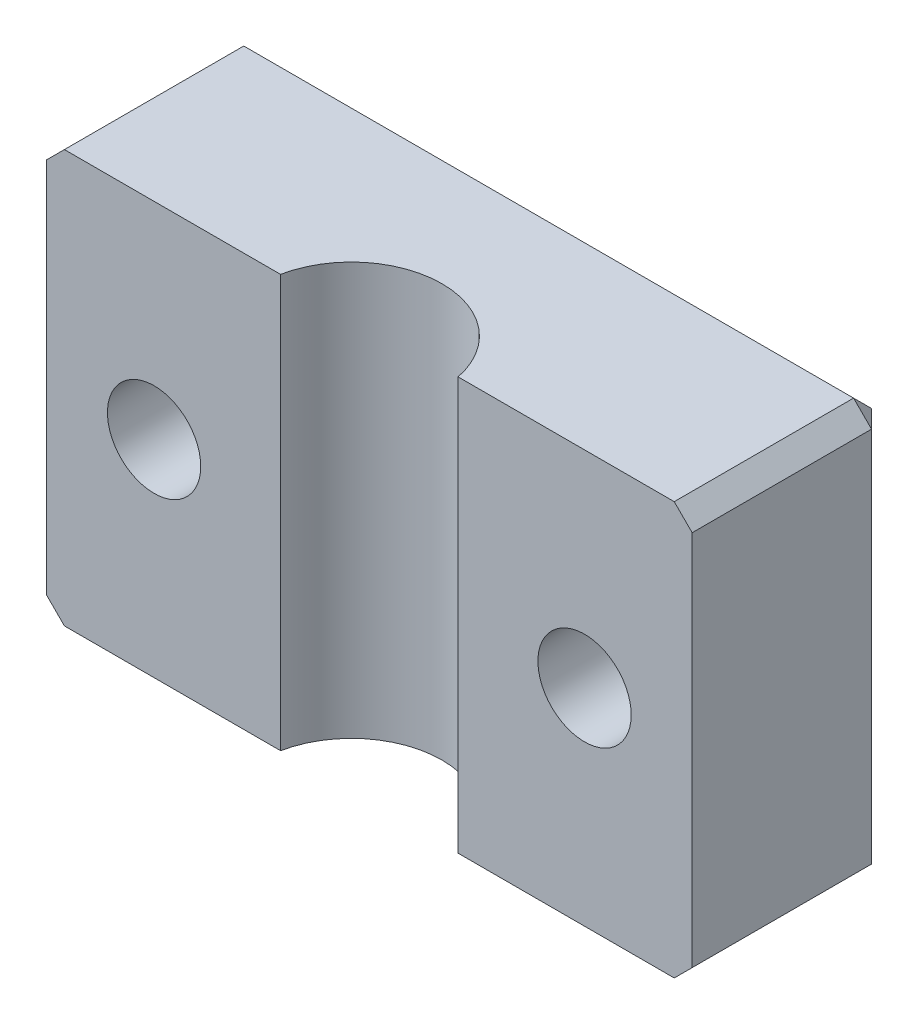
ISO-10303-21;
HEADER;
FILE_DESCRIPTION(('STEP AP214'),'2;1');
FILE_NAME('part.step','',(''),(''),'','','');
FILE_SCHEMA(('AUTOMOTIVE_DESIGN { 1 0 10303 214 1 1 1 1 }'));
ENDSEC;
DATA;
#1=APPLICATION_CONTEXT('core data for automotive mechanical design processes');
#2=APPLICATION_PROTOCOL_DEFINITION('international standard','automotive_design',2000,#1);
#3=PRODUCT_CONTEXT('',#1,'mechanical');
#4=PRODUCT('Part','Part','',(#3));
#5=PRODUCT_RELATED_PRODUCT_CATEGORY('part','',(#4));
#6=PRODUCT_DEFINITION_FORMATION('','',#4);
#7=PRODUCT_DEFINITION_CONTEXT('part definition',#1,'design');
#8=PRODUCT_DEFINITION('design','',#6,#7);
#9=PRODUCT_DEFINITION_SHAPE('','',#8);
#10=(LENGTH_UNIT() NAMED_UNIT(*) SI_UNIT(.MILLI.,.METRE.));
#11=(NAMED_UNIT(*) PLANE_ANGLE_UNIT() SI_UNIT($,.RADIAN.));
#12=(NAMED_UNIT(*) SI_UNIT($,.STERADIAN.) SOLID_ANGLE_UNIT());
#13=UNCERTAINTY_MEASURE_WITH_UNIT(LENGTH_MEASURE(1.E-05),#10,'distance_accuracy_value','');
#14=(GEOMETRIC_REPRESENTATION_CONTEXT(3) GLOBAL_UNCERTAINTY_ASSIGNED_CONTEXT((#13)) GLOBAL_UNIT_ASSIGNED_CONTEXT((#10,
#11,#12)) REPRESENTATION_CONTEXT('',''));
#15=CARTESIAN_POINT('',(0.,0.,0.));
#16=DIRECTION('',(0.,0.,1.));
#17=DIRECTION('',(1.,0.,0.));
#18=AXIS2_PLACEMENT_3D('',#15,#16,#17);
#19=CARTESIAN_POINT('',(-18.,23.,11.));
#20=DIRECTION('',(1.,0.,0.));
#21=DIRECTION('',(0.,0.,-1.));
#22=AXIS2_PLACEMENT_3D('',#19,#20,#21);
#23=PLANE('',#22);
#24=DIRECTION('',(0.,-1.,0.));
#25=VECTOR('',#24,1.);
#26=CARTESIAN_POINT('',(-18.,23.,1.));
#27=LINE('',#26,#25);
#28=CARTESIAN_POINT('',(-18.,22.,1.));
#29=VERTEX_POINT('',#28);
#30=CARTESIAN_POINT('',(-18.,1.,1.));
#31=VERTEX_POINT('',#30);
#32=EDGE_CURVE('E180',#29,#31,#27,.T.);
#33=ORIENTED_EDGE('',*,*,#32,.T.);
#34=DIRECTION('',(0.,0.,1.));
#35=VECTOR('',#34,1.);
#36=CARTESIAN_POINT('',(-18.,1.,11.));
#37=LINE('',#36,#35);
#38=CARTESIAN_POINT('',(-18.,1.00000000000001,11.));
#39=VERTEX_POINT('',#38);
#40=EDGE_CURVE('E184',#31,#39,#37,.T.);
#41=ORIENTED_EDGE('',*,*,#40,.T.);
#42=DIRECTION('',(0.,-1.,0.));
#43=VECTOR('',#42,1.);
#44=CARTESIAN_POINT('',(-18.,23.,11.));
#45=LINE('',#44,#43);
#46=CARTESIAN_POINT('',(-18.,22.,11.));
#47=VERTEX_POINT('',#46);
#48=EDGE_CURVE('E141',#47,#39,#45,.T.);
#49=ORIENTED_EDGE('',*,*,#48,.F.);
#50=DIRECTION('',(0.,0.,-1.));
#51=VECTOR('',#50,1.);
#52=CARTESIAN_POINT('',(-18.,22.,0.));
#53=LINE('',#52,#51);
#54=EDGE_CURVE('E182',#47,#29,#53,.T.);
#55=ORIENTED_EDGE('',*,*,#54,.T.);
#56=EDGE_LOOP('',(#33,#41,#49,#55));
#57=FACE_BOUND('',#56,.T.);
#58=ADVANCED_FACE('F33',(#57),#23,.F.);
#59=CARTESIAN_POINT('',(-4.95,23.,11.));
#60=DIRECTION('',(0.,0.,-1.));
#61=DIRECTION('',(-1.,0.,0.));
#62=AXIS2_PLACEMENT_3D('',#59,#60,#61);
#63=PLANE('',#62);
#64=CARTESIAN_POINT('',(-12.,11.5,11.));
#65=DIRECTION('',(0.,0.,1.));
#66=DIRECTION('',(1.,0.,0.));
#67=AXIS2_PLACEMENT_3D('',#64,#65,#66);
#68=CIRCLE('',#67,2.6);
#69=CARTESIAN_POINT('',(-9.4,11.5,11.));
#70=VERTEX_POINT('',#69);
#71=EDGE_CURVE('E243',#70,#70,#68,.T.);
#72=ORIENTED_EDGE('',*,*,#71,.F.);
#73=EDGE_LOOP('',(#72));
#74=FACE_BOUND('',#73,.T.);
#75=ORIENTED_EDGE('',*,*,#48,.T.);
#76=DIRECTION('',(-0.707106781186549,0.707106781186546,0.));
#77=VECTOR('',#76,1.);
#78=CARTESIAN_POINT('',(-18.,1.,11.));
#79=LINE('',#78,#77);
#80=CARTESIAN_POINT('',(-17.,0.,11.));
#81=VERTEX_POINT('',#80);
#82=EDGE_CURVE('E188',#39,#81,#79,.F.);
#83=ORIENTED_EDGE('',*,*,#82,.T.);
#84=DIRECTION('',(1.,0.,0.));
#85=VECTOR('',#84,1.);
#86=CARTESIAN_POINT('',(-4.95,0.,11.));
#87=LINE('',#86,#85);
#88=CARTESIAN_POINT('',(-4.95,0.,11.));
#89=VERTEX_POINT('',#88);
#90=EDGE_CURVE('E138',#81,#89,#87,.T.);
#91=ORIENTED_EDGE('',*,*,#90,.T.);
#92=DIRECTION('',(0.,-1.,0.));
#93=VECTOR('',#92,1.);
#94=CARTESIAN_POINT('',(-4.95,23.,11.));
#95=LINE('',#94,#93);
#96=CARTESIAN_POINT('',(-4.95,23.,11.));
#97=VERTEX_POINT('',#96);
#98=EDGE_CURVE('E134',#97,#89,#95,.T.);
#99=ORIENTED_EDGE('',*,*,#98,.F.);
#100=DIRECTION('',(1.,0.,0.));
#101=VECTOR('',#100,1.);
#102=CARTESIAN_POINT('',(-4.95,23.,11.));
#103=LINE('',#102,#101);
#104=CARTESIAN_POINT('',(-17.,23.,11.));
#105=VERTEX_POINT('',#104);
#106=EDGE_CURVE('E120',#105,#97,#103,.T.);
#107=ORIENTED_EDGE('',*,*,#106,.F.);
#108=DIRECTION('',(-0.707106781186546,-0.707106781186549,0.));
#109=VECTOR('',#108,1.);
#110=CARTESIAN_POINT('',(-17.,23.,11.));
#111=LINE('',#110,#109);
#112=EDGE_CURVE('E186',#105,#47,#111,.T.);
#113=ORIENTED_EDGE('',*,*,#112,.T.);
#114=EDGE_LOOP('',(#75,#83,#91,#99,#107,#113));
#115=FACE_BOUND('',#114,.T.);
#116=ADVANCED_FACE('F136',(#74,#115),#63,.F.);
#117=CARTESIAN_POINT('',(0.,23.,12.));
#118=DIRECTION('',(0.,-1.,0.));
#119=DIRECTION('',(0.,0.,-1.));
#120=AXIS2_PLACEMENT_3D('',#117,#118,#119);
#121=CYLINDRICAL_SURFACE('',#120,5.05);
#122=CARTESIAN_POINT('',(0.,0.,12.));
#123=DIRECTION('',(0.,-1.,0.));
#124=DIRECTION('',(0.,0.,1.));
#125=AXIS2_PLACEMENT_3D('',#122,#123,#124);
#126=CIRCLE('',#125,5.05);
#127=CARTESIAN_POINT('',(4.95,0.,11.));
#128=VERTEX_POINT('',#127);
#129=EDGE_CURVE('E154',#89,#128,#126,.T.);
#130=ORIENTED_EDGE('',*,*,#129,.T.);
#131=DIRECTION('',(0.,-1.,0.));
#132=VECTOR('',#131,1.);
#133=CARTESIAN_POINT('',(4.95,23.,11.));
#134=LINE('',#133,#132);
#135=CARTESIAN_POINT('',(4.95,23.,11.));
#136=VERTEX_POINT('',#135);
#137=EDGE_CURVE('E142',#136,#128,#134,.T.);
#138=ORIENTED_EDGE('',*,*,#137,.F.);
#139=CARTESIAN_POINT('',(0.,23.,12.));
#140=DIRECTION('',(0.,-1.,0.));
#141=DIRECTION('',(0.,0.,1.));
#142=AXIS2_PLACEMENT_3D('',#139,#140,#141);
#143=CIRCLE('',#142,5.05);
#144=EDGE_CURVE('E125',#97,#136,#143,.T.);
#145=ORIENTED_EDGE('',*,*,#144,.F.);
#146=ORIENTED_EDGE('',*,*,#98,.T.);
#147=EDGE_LOOP('',(#130,#138,#145,#146));
#148=FACE_BOUND('',#147,.T.);
#149=ADVANCED_FACE('F144',(#148),#121,.F.);
#150=CARTESIAN_POINT('',(18.,23.,11.));
#151=DIRECTION('',(0.,0.,-1.));
#152=DIRECTION('',(-1.,0.,0.));
#153=AXIS2_PLACEMENT_3D('',#150,#151,#152);
#154=PLANE('',#153);
#155=CARTESIAN_POINT('',(12.,11.5,11.));
#156=DIRECTION('',(0.,0.,1.));
#157=DIRECTION('',(1.,0.,0.));
#158=AXIS2_PLACEMENT_3D('',#155,#156,#157);
#159=CIRCLE('',#158,2.6);
#160=CARTESIAN_POINT('',(14.6,11.5,11.));
#161=VERTEX_POINT('',#160);
#162=EDGE_CURVE('E233',#161,#161,#159,.T.);
#163=ORIENTED_EDGE('',*,*,#162,.F.);
#164=EDGE_LOOP('',(#163));
#165=FACE_BOUND('',#164,.T.);
#166=DIRECTION('',(1.,0.,0.));
#167=VECTOR('',#166,1.);
#168=CARTESIAN_POINT('',(18.,0.,11.));
#169=LINE('',#168,#167);
#170=CARTESIAN_POINT('',(17.,0.,11.));
#171=VERTEX_POINT('',#170);
#172=EDGE_CURVE('E131',#128,#171,#169,.T.);
#173=ORIENTED_EDGE('',*,*,#172,.T.);
#174=DIRECTION('',(-0.707106781186549,-0.707106781186546,0.));
#175=VECTOR('',#174,1.);
#176=CARTESIAN_POINT('',(18.,1.,11.));
#177=LINE('',#176,#175);
#178=CARTESIAN_POINT('',(18.,1.00000000000001,11.));
#179=VERTEX_POINT('',#178);
#180=EDGE_CURVE('E178',#171,#179,#177,.F.);
#181=ORIENTED_EDGE('',*,*,#180,.T.);
#182=DIRECTION('',(0.,-1.,0.));
#183=VECTOR('',#182,1.);
#184=CARTESIAN_POINT('',(18.,23.,11.));
#185=LINE('',#184,#183);
#186=CARTESIAN_POINT('',(18.,22.,11.));
#187=VERTEX_POINT('',#186);
#188=EDGE_CURVE('E149',#187,#179,#185,.T.);
#189=ORIENTED_EDGE('',*,*,#188,.F.);
#190=DIRECTION('',(-0.707106781186546,0.707106781186549,0.));
#191=VECTOR('',#190,1.);
#192=CARTESIAN_POINT('',(17.,23.,11.));
#193=LINE('',#192,#191);
#194=CARTESIAN_POINT('',(17.,23.,11.));
#195=VERTEX_POINT('',#194);
#196=EDGE_CURVE('E176',#187,#195,#193,.T.);
#197=ORIENTED_EDGE('',*,*,#196,.T.);
#198=DIRECTION('',(1.,0.,0.));
#199=VECTOR('',#198,1.);
#200=CARTESIAN_POINT('',(18.,23.,11.));
#201=LINE('',#200,#199);
#202=EDGE_CURVE('E147',#136,#195,#201,.T.);
#203=ORIENTED_EDGE('',*,*,#202,.F.);
#204=ORIENTED_EDGE('',*,*,#137,.T.);
#205=EDGE_LOOP('',(#173,#181,#189,#197,#203,#204));
#206=FACE_BOUND('',#205,.T.);
#207=ADVANCED_FACE('F262',(#165,#206),#154,.F.);
#208=CARTESIAN_POINT('',(18.,23.,0.));
#209=DIRECTION('',(-1.,0.,0.));
#210=DIRECTION('',(0.,0.,1.));
#211=AXIS2_PLACEMENT_3D('',#208,#209,#210);
#212=PLANE('',#211);
#213=ORIENTED_EDGE('',*,*,#188,.T.);
#214=DIRECTION('',(0.,0.,-1.));
#215=VECTOR('',#214,1.);
#216=CARTESIAN_POINT('',(18.,1.,0.));
#217=LINE('',#216,#215);
#218=CARTESIAN_POINT('',(18.,1.,0.999999999999997));
#219=VERTEX_POINT('',#218);
#220=EDGE_CURVE('E167',#179,#219,#217,.T.);
#221=ORIENTED_EDGE('',*,*,#220,.T.);
#222=DIRECTION('',(0.,1.,0.));
#223=VECTOR('',#222,1.);
#224=CARTESIAN_POINT('',(18.,23.,0.999999999999997));
#225=LINE('',#224,#223);
#226=CARTESIAN_POINT('',(18.,22.,0.999999999999997));
#227=VERTEX_POINT('',#226);
#228=EDGE_CURVE('E163',#219,#227,#225,.T.);
#229=ORIENTED_EDGE('',*,*,#228,.T.);
#230=DIRECTION('',(0.,0.,1.));
#231=VECTOR('',#230,1.);
#232=CARTESIAN_POINT('',(18.,22.,11.));
#233=LINE('',#232,#231);
#234=EDGE_CURVE('E165',#227,#187,#233,.T.);
#235=ORIENTED_EDGE('',*,*,#234,.T.);
#236=EDGE_LOOP('',(#213,#221,#229,#235));
#237=FACE_BOUND('',#236,.T.);
#238=ADVANCED_FACE('F254',(#237),#212,.F.);
#239=CARTESIAN_POINT('',(-18.,23.,0.));
#240=DIRECTION('',(0.,0.,1.));
#241=DIRECTION('',(1.,0.,0.));
#242=AXIS2_PLACEMENT_3D('',#239,#240,#241);
#243=PLANE('',#242);
#244=DIRECTION('',(-1.,0.,0.));
#245=VECTOR('',#244,1.);
#246=CARTESIAN_POINT('',(-18.,1.,0.));
#247=LINE('',#246,#245);
#248=CARTESIAN_POINT('',(17.,1.,0.));
#249=VERTEX_POINT('',#248);
#250=CARTESIAN_POINT('',(-17.,1.,0.));
#251=VERTEX_POINT('',#250);
#252=EDGE_CURVE('E42',#249,#251,#247,.T.);
#253=ORIENTED_EDGE('',*,*,#252,.T.);
#254=DIRECTION('',(0.,1.,0.));
#255=VECTOR('',#254,1.);
#256=CARTESIAN_POINT('',(-17.,23.,0.));
#257=LINE('',#256,#255);
#258=CARTESIAN_POINT('',(-17.,22.,0.));
#259=VERTEX_POINT('',#258);
#260=EDGE_CURVE('E11',#251,#259,#257,.T.);
#261=ORIENTED_EDGE('',*,*,#260,.T.);
#262=DIRECTION('',(1.,0.,0.));
#263=VECTOR('',#262,1.);
#264=CARTESIAN_POINT('',(18.,22.,0.));
#265=LINE('',#264,#263);
#266=CARTESIAN_POINT('',(17.,22.,0.));
#267=VERTEX_POINT('',#266);
#268=EDGE_CURVE('E195',#259,#267,#265,.T.);
#269=ORIENTED_EDGE('',*,*,#268,.T.);
#270=DIRECTION('',(0.,-1.,0.));
#271=VECTOR('',#270,1.);
#272=CARTESIAN_POINT('',(17.,23.,0.));
#273=LINE('',#272,#271);
#274=EDGE_CURVE('E53',#267,#249,#273,.T.);
#275=ORIENTED_EDGE('',*,*,#274,.T.);
#276=EDGE_LOOP('',(#253,#261,#269,#275));
#277=FACE_BOUND('',#276,.T.);
#278=CARTESIAN_POINT('',(12.,11.5,0.));
#279=DIRECTION('',(0.,0.,1.));
#280=DIRECTION('',(1.,0.,0.));
#281=AXIS2_PLACEMENT_3D('',#278,#279,#280);
#282=CIRCLE('',#281,2.6);
#283=CARTESIAN_POINT('',(14.6,11.5,0.));
#284=VERTEX_POINT('',#283);
#285=EDGE_CURVE('E238',#284,#284,#282,.F.);
#286=ORIENTED_EDGE('',*,*,#285,.F.);
#287=EDGE_LOOP('',(#286));
#288=FACE_BOUND('',#287,.T.);
#289=CARTESIAN_POINT('',(-12.,11.5,0.));
#290=DIRECTION('',(0.,0.,1.));
#291=DIRECTION('',(1.,0.,0.));
#292=AXIS2_PLACEMENT_3D('',#289,#290,#291);
#293=CIRCLE('',#292,2.6);
#294=CARTESIAN_POINT('',(-9.4,11.5,0.));
#295=VERTEX_POINT('',#294);
#296=EDGE_CURVE('E155',#295,#295,#293,.F.);
#297=ORIENTED_EDGE('',*,*,#296,.F.);
#298=EDGE_LOOP('',(#297));
#299=FACE_BOUND('',#298,.T.);
#300=ADVANCED_FACE('F252',(#277,#288,#299),#243,.F.);
#301=CARTESIAN_POINT('',(0.,23.,12.));
#302=DIRECTION('',(0.,1.,0.));
#303=DIRECTION('',(0.,0.,1.));
#304=AXIS2_PLACEMENT_3D('',#301,#302,#303);
#305=PLANE('',#304);
#306=DIRECTION('',(-1.,0.,0.));
#307=VECTOR('',#306,1.);
#308=CARTESIAN_POINT('',(-18.,23.,1.));
#309=LINE('',#308,#307);
#310=CARTESIAN_POINT('',(17.,23.,0.999999999999997));
#311=VERTEX_POINT('',#310);
#312=CARTESIAN_POINT('',(-17.,23.,1.));
#313=VERTEX_POINT('',#312);
#314=EDGE_CURVE('E190',#311,#313,#309,.T.);
#315=ORIENTED_EDGE('',*,*,#314,.T.);
#316=DIRECTION('',(0.,0.,1.));
#317=VECTOR('',#316,1.);
#318=CARTESIAN_POINT('',(-17.,23.,11.));
#319=LINE('',#318,#317);
#320=EDGE_CURVE('E128',#313,#105,#319,.T.);
#321=ORIENTED_EDGE('',*,*,#320,.T.);
#322=ORIENTED_EDGE('',*,*,#106,.T.);
#323=ORIENTED_EDGE('',*,*,#144,.T.);
#324=ORIENTED_EDGE('',*,*,#202,.T.);
#325=DIRECTION('',(0.,0.,-1.));
#326=VECTOR('',#325,1.);
#327=CARTESIAN_POINT('',(17.,23.,0.));
#328=LINE('',#327,#326);
#329=EDGE_CURVE('E192',#195,#311,#328,.T.);
#330=ORIENTED_EDGE('',*,*,#329,.T.);
#331=EDGE_LOOP('',(#315,#321,#322,#323,#324,#330));
#332=FACE_BOUND('',#331,.T.);
#333=ADVANCED_FACE('F122',(#332),#305,.T.);
#334=CARTESIAN_POINT('',(0.,0.,12.));
#335=DIRECTION('',(0.,1.,0.));
#336=DIRECTION('',(0.,0.,1.));
#337=AXIS2_PLACEMENT_3D('',#334,#335,#336);
#338=PLANE('',#337);
#339=DIRECTION('',(1.,0.,0.));
#340=VECTOR('',#339,1.);
#341=CARTESIAN_POINT('',(0.,0.,0.999999999999999));
#342=LINE('',#341,#340);
#343=CARTESIAN_POINT('',(-17.,0.,1.));
#344=VERTEX_POINT('',#343);
#345=CARTESIAN_POINT('',(17.,0.,0.999999999999997));
#346=VERTEX_POINT('',#345);
#347=EDGE_CURVE('E170',#344,#346,#342,.T.);
#348=ORIENTED_EDGE('',*,*,#347,.T.);
#349=DIRECTION('',(0.,0.,1.));
#350=VECTOR('',#349,1.);
#351=CARTESIAN_POINT('',(17.,0.,12.));
#352=LINE('',#351,#350);
#353=EDGE_CURVE('E174',#346,#171,#352,.T.);
#354=ORIENTED_EDGE('',*,*,#353,.T.);
#355=ORIENTED_EDGE('',*,*,#172,.F.);
#356=ORIENTED_EDGE('',*,*,#129,.F.);
#357=ORIENTED_EDGE('',*,*,#90,.F.);
#358=DIRECTION('',(0.,0.,-1.));
#359=VECTOR('',#358,1.);
#360=CARTESIAN_POINT('',(-17.,0.,12.));
#361=LINE('',#360,#359);
#362=EDGE_CURVE('E172',#81,#344,#361,.T.);
#363=ORIENTED_EDGE('',*,*,#362,.T.);
#364=EDGE_LOOP('',(#348,#354,#355,#356,#357,#363));
#365=FACE_BOUND('',#364,.T.);
#366=ADVANCED_FACE('F260',(#365),#338,.F.);
#367=CARTESIAN_POINT('',(-12.,11.5,-0.00100000000000447));
#368=DIRECTION('',(0.,0.,1.));
#369=DIRECTION('',(1.,0.,0.));
#370=AXIS2_PLACEMENT_3D('',#367,#368,#369);
#371=CYLINDRICAL_SURFACE('',#370,2.6);
#372=ORIENTED_EDGE('',*,*,#71,.T.);
#373=EDGE_LOOP('',(#372));
#374=FACE_BOUND('',#373,.T.);
#375=ORIENTED_EDGE('',*,*,#296,.T.);
#376=EDGE_LOOP('',(#375));
#377=FACE_BOUND('',#376,.T.);
#378=ADVANCED_FACE('F250',(#374,#377),#371,.F.);
#379=CARTESIAN_POINT('',(12.,11.5,-0.00100000000000447));
#380=DIRECTION('',(0.,0.,1.));
#381=DIRECTION('',(1.,0.,0.));
#382=AXIS2_PLACEMENT_3D('',#379,#380,#381);
#383=CYLINDRICAL_SURFACE('',#382,2.6);
#384=ORIENTED_EDGE('',*,*,#162,.T.);
#385=EDGE_LOOP('',(#384));
#386=FACE_BOUND('',#385,.T.);
#387=ORIENTED_EDGE('',*,*,#285,.T.);
#388=EDGE_LOOP('',(#387));
#389=FACE_BOUND('',#388,.T.);
#390=ADVANCED_FACE('F320',(#386,#389),#383,.F.);
#391=CARTESIAN_POINT('',(-17.,23.,12.));
#392=DIRECTION('',(-0.707106781186549,0.707106781186546,0.));
#393=DIRECTION('',(0.,0.,-1.));
#394=AXIS2_PLACEMENT_3D('',#391,#392,#393);
#395=PLANE('',#394);
#396=DIRECTION('',(0.707106781186546,0.707106781186549,0.));
#397=VECTOR('',#396,1.);
#398=CARTESIAN_POINT('',(-18.,22.,1.));
#399=LINE('',#398,#397);
#400=EDGE_CURVE('E37',#29,#313,#399,.T.);
#401=ORIENTED_EDGE('',*,*,#400,.F.);
#402=ORIENTED_EDGE('',*,*,#54,.F.);
#403=ORIENTED_EDGE('',*,*,#112,.F.);
#404=ORIENTED_EDGE('',*,*,#320,.F.);
#405=EDGE_LOOP('',(#401,#402,#403,#404));
#406=FACE_BOUND('',#405,.T.);
#407=ADVANCED_FACE('F35',(#406),#395,.T.);
#408=CARTESIAN_POINT('',(-18.,22.,1.));
#409=DIRECTION('',(-0.577350269189626,0.577350269189624,-0.577350269189628));
#410=DIRECTION('',(-0.707106781186549,0.,0.707106781186546));
#411=AXIS2_PLACEMENT_3D('',#408,#409,#410);
#412=PLANE('',#411);
#413=DIRECTION('',(0.707106781186549,0.,-0.707106781186546));
#414=VECTOR('',#413,1.);
#415=CARTESIAN_POINT('',(-18.,22.,1.));
#416=LINE('',#415,#414);
#417=EDGE_CURVE('E225',#29,#259,#416,.T.);
#418=ORIENTED_EDGE('',*,*,#417,.F.);
#419=ORIENTED_EDGE('',*,*,#400,.T.);
#420=DIRECTION('',(0.,-0.707106781186549,-0.707106781186546));
#421=VECTOR('',#420,1.);
#422=CARTESIAN_POINT('',(-17.,22.5,0.5));
#423=LINE('',#422,#421);
#424=EDGE_CURVE('E227',#259,#313,#423,.F.);
#425=ORIENTED_EDGE('',*,*,#424,.F.);
#426=EDGE_LOOP('',(#418,#419,#425));
#427=FACE_BOUND('',#426,.T.);
#428=ADVANCED_FACE('F314',(#427),#412,.T.);
#429=CARTESIAN_POINT('',(17.,23.,12.));
#430=DIRECTION('',(0.707106781186549,0.707106781186546,0.));
#431=DIRECTION('',(0.,0.,1.));
#432=AXIS2_PLACEMENT_3D('',#429,#430,#431);
#433=PLANE('',#432);
#434=ORIENTED_EDGE('',*,*,#196,.F.);
#435=ORIENTED_EDGE('',*,*,#234,.F.);
#436=DIRECTION('',(0.707106781186546,-0.707106781186549,0.));
#437=VECTOR('',#436,1.);
#438=CARTESIAN_POINT('',(17.,23.,0.999999999999997));
#439=LINE('',#438,#437);
#440=EDGE_CURVE('E222',#311,#227,#439,.T.);
#441=ORIENTED_EDGE('',*,*,#440,.F.);
#442=ORIENTED_EDGE('',*,*,#329,.F.);
#443=EDGE_LOOP('',(#434,#435,#441,#442));
#444=FACE_BOUND('',#443,.T.);
#445=ADVANCED_FACE('F312',(#444),#433,.T.);
#446=CARTESIAN_POINT('',(0.,23.,0.999999999999999));
#447=DIRECTION('',(0.,0.707106781186546,-0.707106781186549));
#448=DIRECTION('',(1.,0.,0.));
#449=AXIS2_PLACEMENT_3D('',#446,#447,#448);
#450=PLANE('',#449);
#451=ORIENTED_EDGE('',*,*,#424,.T.);
#452=ORIENTED_EDGE('',*,*,#314,.F.);
#453=DIRECTION('',(0.,0.707106781186548,0.707106781186546));
#454=VECTOR('',#453,1.);
#455=CARTESIAN_POINT('',(17.,23.,0.999999999999997));
#456=LINE('',#455,#454);
#457=EDGE_CURVE('E219',#267,#311,#456,.T.);
#458=ORIENTED_EDGE('',*,*,#457,.F.);
#459=ORIENTED_EDGE('',*,*,#268,.F.);
#460=EDGE_LOOP('',(#451,#452,#458,#459));
#461=FACE_BOUND('',#460,.T.);
#462=ADVANCED_FACE('F308',(#461),#450,.T.);
#463=CARTESIAN_POINT('',(-18.,23.,1.));
#464=DIRECTION('',(0.707106781186546,0.,0.707106781186549));
#465=DIRECTION('',(0.,-1.,0.));
#466=AXIS2_PLACEMENT_3D('',#463,#464,#465);
#467=PLANE('',#466);
#468=ORIENTED_EDGE('',*,*,#417,.T.);
#469=ORIENTED_EDGE('',*,*,#260,.F.);
#470=DIRECTION('',(-0.707106781186549,0.,0.707106781186546));
#471=VECTOR('',#470,1.);
#472=CARTESIAN_POINT('',(-17.5,1.,0.5));
#473=LINE('',#472,#471);
#474=EDGE_CURVE('E216',#31,#251,#473,.F.);
#475=ORIENTED_EDGE('',*,*,#474,.F.);
#476=ORIENTED_EDGE('',*,*,#32,.F.);
#477=EDGE_LOOP('',(#468,#469,#475,#476));
#478=FACE_BOUND('',#477,.T.);
#479=ADVANCED_FACE('F304',(#478),#467,.F.);
#480=CARTESIAN_POINT('',(-18.,1.,11.));
#481=DIRECTION('',(0.707106781186546,0.707106781186549,0.));
#482=DIRECTION('',(0.,0.,1.));
#483=AXIS2_PLACEMENT_3D('',#480,#481,#482);
#484=PLANE('',#483);
#485=ORIENTED_EDGE('',*,*,#82,.F.);
#486=ORIENTED_EDGE('',*,*,#40,.F.);
#487=DIRECTION('',(0.707106781186549,-0.707106781186546,0.));
#488=VECTOR('',#487,1.);
#489=CARTESIAN_POINT('',(-17.,0.,1.));
#490=LINE('',#489,#488);
#491=EDGE_CURVE('E213',#344,#31,#490,.F.);
#492=ORIENTED_EDGE('',*,*,#491,.F.);
#493=ORIENTED_EDGE('',*,*,#362,.F.);
#494=EDGE_LOOP('',(#485,#486,#492,#493));
#495=FACE_BOUND('',#494,.T.);
#496=ADVANCED_FACE('F300',(#495),#484,.F.);
#497=CARTESIAN_POINT('',(17.,23.,0.999999999999997));
#498=DIRECTION('',(0.577350269189625,0.577350269189623,-0.577350269189629));
#499=DIRECTION('',(-0.70710678118655,0.,-0.707106781186545));
#500=AXIS2_PLACEMENT_3D('',#497,#498,#499);
#501=PLANE('',#500);
#502=ORIENTED_EDGE('',*,*,#457,.T.);
#503=ORIENTED_EDGE('',*,*,#440,.T.);
#504=DIRECTION('',(0.70710678118655,0.,0.707106781186545));
#505=VECTOR('',#504,1.);
#506=CARTESIAN_POINT('',(17.5,22.,0.499999999999996));
#507=LINE('',#506,#505);
#508=EDGE_CURVE('E210',#267,#227,#507,.T.);
#509=ORIENTED_EDGE('',*,*,#508,.F.);
#510=EDGE_LOOP('',(#502,#503,#509));
#511=FACE_BOUND('',#510,.T.);
#512=ADVANCED_FACE('F296',(#511),#501,.T.);
#513=CARTESIAN_POINT('',(-17.,0.,1.));
#514=DIRECTION('',(-0.577350269189624,-0.577350269189626,-0.577350269189628));
#515=DIRECTION('',(0.,0.707106781186548,-0.707106781186547));
#516=AXIS2_PLACEMENT_3D('',#513,#514,#515);
#517=PLANE('',#516);
#518=ORIENTED_EDGE('',*,*,#491,.T.);
#519=ORIENTED_EDGE('',*,*,#474,.T.);
#520=DIRECTION('',(0.,0.707106781186549,-0.707106781186546));
#521=VECTOR('',#520,1.);
#522=CARTESIAN_POINT('',(-17.,0.,1.));
#523=LINE('',#522,#521);
#524=EDGE_CURVE('E207',#344,#251,#523,.T.);
#525=ORIENTED_EDGE('',*,*,#524,.F.);
#526=EDGE_LOOP('',(#518,#519,#525));
#527=FACE_BOUND('',#526,.T.);
#528=ADVANCED_FACE('F292',(#527),#517,.T.);
#529=CARTESIAN_POINT('',(17.,23.,0.));
#530=DIRECTION('',(-0.707106781186545,0.,0.70710678118655));
#531=DIRECTION('',(0.,-1.,0.));
#532=AXIS2_PLACEMENT_3D('',#529,#530,#531);
#533=PLANE('',#532);
#534=ORIENTED_EDGE('',*,*,#508,.T.);
#535=ORIENTED_EDGE('',*,*,#228,.F.);
#536=DIRECTION('',(-0.70710678118655,0.,-0.707106781186545));
#537=VECTOR('',#536,1.);
#538=CARTESIAN_POINT('',(18.,1.,0.999999999999997));
#539=LINE('',#538,#537);
#540=EDGE_CURVE('E204',#249,#219,#539,.F.);
#541=ORIENTED_EDGE('',*,*,#540,.F.);
#542=ORIENTED_EDGE('',*,*,#274,.F.);
#543=EDGE_LOOP('',(#534,#535,#541,#542));
#544=FACE_BOUND('',#543,.T.);
#545=ADVANCED_FACE('F288',(#544),#533,.F.);
#546=CARTESIAN_POINT('',(-18.,1.,0.));
#547=DIRECTION('',(0.,0.707106781186546,0.707106781186549));
#548=DIRECTION('',(-1.,0.,0.));
#549=AXIS2_PLACEMENT_3D('',#546,#547,#548);
#550=PLANE('',#549);
#551=ORIENTED_EDGE('',*,*,#524,.T.);
#552=ORIENTED_EDGE('',*,*,#252,.F.);
#553=DIRECTION('',(0.,-0.707106781186549,0.707106781186547));
#554=VECTOR('',#553,1.);
#555=CARTESIAN_POINT('',(17.,0.500000000000001,0.499999999999998));
#556=LINE('',#555,#554);
#557=EDGE_CURVE('E201',#346,#249,#556,.F.);
#558=ORIENTED_EDGE('',*,*,#557,.F.);
#559=ORIENTED_EDGE('',*,*,#347,.F.);
#560=EDGE_LOOP('',(#551,#552,#558,#559));
#561=FACE_BOUND('',#560,.T.);
#562=ADVANCED_FACE('F284',(#561),#550,.F.);
#563=CARTESIAN_POINT('',(18.,1.,0.999999999999997));
#564=DIRECTION('',(0.577350269189623,-0.577350269189625,-0.577350269189629));
#565=DIRECTION('',(0.,0.70710678118655,-0.707106781186545));
#566=AXIS2_PLACEMENT_3D('',#563,#564,#565);
#567=PLANE('',#566);
#568=ORIENTED_EDGE('',*,*,#557,.T.);
#569=ORIENTED_EDGE('',*,*,#540,.T.);
#570=DIRECTION('',(0.707106781186549,0.707106781186546,0.));
#571=VECTOR('',#570,1.);
#572=CARTESIAN_POINT('',(18.,1.,0.999999999999997));
#573=LINE('',#572,#571);
#574=EDGE_CURVE('E199',#346,#219,#573,.T.);
#575=ORIENTED_EDGE('',*,*,#574,.F.);
#576=EDGE_LOOP('',(#568,#569,#575));
#577=FACE_BOUND('',#576,.T.);
#578=ADVANCED_FACE('F280',(#577),#567,.T.);
#579=CARTESIAN_POINT('',(18.,1.,0.));
#580=DIRECTION('',(-0.707106781186546,0.707106781186549,0.));
#581=DIRECTION('',(0.,0.,-1.));
#582=AXIS2_PLACEMENT_3D('',#579,#580,#581);
#583=PLANE('',#582);
#584=ORIENTED_EDGE('',*,*,#180,.F.);
#585=ORIENTED_EDGE('',*,*,#353,.F.);
#586=ORIENTED_EDGE('',*,*,#574,.T.);
#587=ORIENTED_EDGE('',*,*,#220,.F.);
#588=EDGE_LOOP('',(#584,#585,#586,#587));
#589=FACE_BOUND('',#588,.T.);
#590=ADVANCED_FACE('F277',(#589),#583,.F.);
#591=CLOSED_SHELL('',(#58,#116,#149,#207,#238,#300,#333,#366,#378,#390,#407,#428,#445,#462,#479,
#496,#512,#528,#545,#562,#578,#590));
#592=MANIFOLD_SOLID_BREP('B2',#591);
#593=ADVANCED_BREP_SHAPE_REPRESENTATION('',(#18,#592),#14);
#594=SHAPE_DEFINITION_REPRESENTATION(#9,#593);
ENDSEC;
END-ISO-10303-21;
